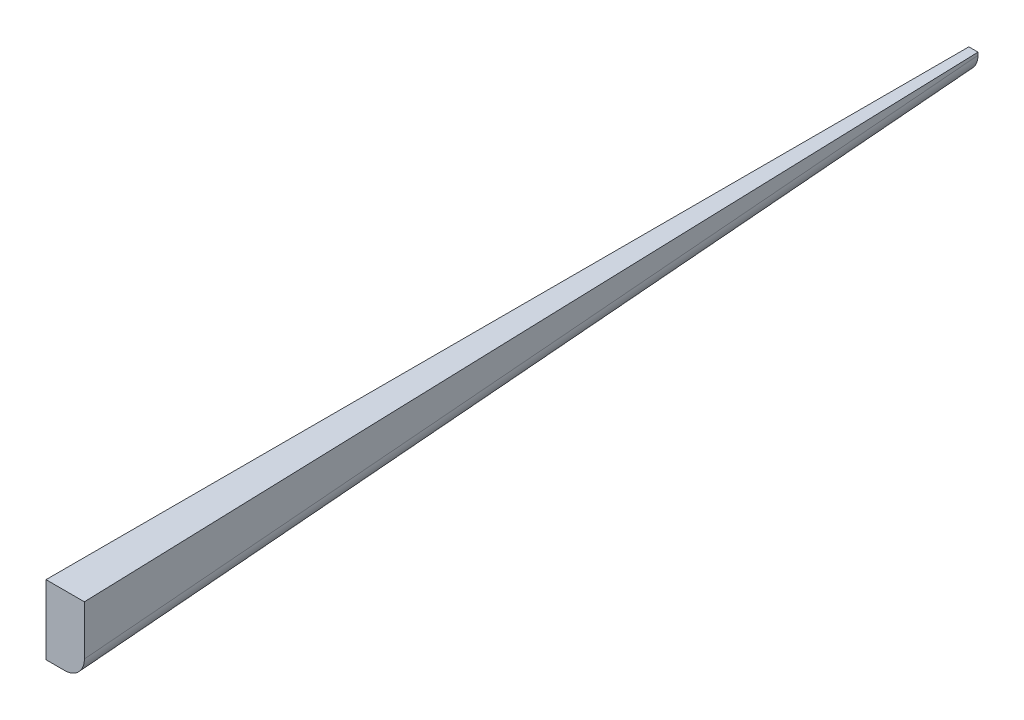
ISO-10303-21;
HEADER;
FILE_DESCRIPTION(('STEP AP214'),'2;1');
FILE_NAME('part.step','',(''),(''),'','','');
FILE_SCHEMA(('AUTOMOTIVE_DESIGN { 1 0 10303 214 1 1 1 1 }'));
ENDSEC;
DATA;
#1=APPLICATION_CONTEXT('core data for automotive mechanical design processes');
#2=APPLICATION_PROTOCOL_DEFINITION('international standard','automotive_design',2000,#1);
#3=PRODUCT_CONTEXT('',#1,'mechanical');
#4=PRODUCT('Part','Part','',(#3));
#5=PRODUCT_RELATED_PRODUCT_CATEGORY('part','',(#4));
#6=PRODUCT_DEFINITION_FORMATION('','',#4);
#7=PRODUCT_DEFINITION_CONTEXT('part definition',#1,'design');
#8=PRODUCT_DEFINITION('design','',#6,#7);
#9=PRODUCT_DEFINITION_SHAPE('','',#8);
#10=(LENGTH_UNIT() NAMED_UNIT(*) SI_UNIT(.MILLI.,.METRE.));
#11=(NAMED_UNIT(*) PLANE_ANGLE_UNIT() SI_UNIT($,.RADIAN.));
#12=(NAMED_UNIT(*) SI_UNIT($,.STERADIAN.) SOLID_ANGLE_UNIT());
#13=UNCERTAINTY_MEASURE_WITH_UNIT(LENGTH_MEASURE(1.E-05),#10,'distance_accuracy_value','');
#14=(GEOMETRIC_REPRESENTATION_CONTEXT(3) GLOBAL_UNCERTAINTY_ASSIGNED_CONTEXT((#13)) GLOBAL_UNIT_ASSIGNED_CONTEXT((#10,
#11,#12)) REPRESENTATION_CONTEXT('',''));
#15=CARTESIAN_POINT('',(0.,0.,0.));
#16=DIRECTION('',(0.,0.,1.));
#17=DIRECTION('',(1.,0.,0.));
#18=AXIS2_PLACEMENT_3D('',#15,#16,#17);
#19=CARTESIAN_POINT('',(0.,0.,-584.2));
#20=DIRECTION('',(0.,0.,1.));
#21=DIRECTION('',(1.,0.,0.));
#22=AXIS2_PLACEMENT_3D('',#19,#20,#21);
#23=PLANE('',#22);
#24=DIRECTION('',(1.,0.,0.));
#25=VECTOR('',#24,1.);
#26=CARTESIAN_POINT('',(0.,5.96900000000002,-584.2));
#27=LINE('',#26,#25);
#28=CARTESIAN_POINT('',(18.161,5.96900000000002,-584.2));
#29=VERTEX_POINT('',#28);
#30=CARTESIAN_POINT('',(42.6703226354349,5.96900000000002,-584.2));
#31=VERTEX_POINT('',#30);
#32=EDGE_CURVE('E111',#29,#31,#27,.T.);
#33=ORIENTED_EDGE('',*,*,#32,.F.);
#34=DIRECTION('',(0.,-1.,0.));
#35=VECTOR('',#34,1.);
#36=CARTESIAN_POINT('',(18.161,0.,-584.2));
#37=LINE('',#36,#35);
#38=CARTESIAN_POINT('',(18.161,-38.3259162166958,-584.2));
#39=VERTEX_POINT('',#38);
#40=EDGE_CURVE('E98',#29,#39,#37,.T.);
#41=ORIENTED_EDGE('',*,*,#40,.T.);
#42=DIRECTION('',(1.,0.,0.));
#43=VECTOR('',#42,1.);
#44=CARTESIAN_POINT('',(0.,-38.3259162166958,-584.2));
#45=LINE('',#44,#43);
#46=CARTESIAN_POINT('',(29.9843258252833,-38.3259162166958,-584.2));
#47=VERTEX_POINT('',#46);
#48=EDGE_CURVE('E109',#39,#47,#45,.T.);
#49=ORIENTED_EDGE('',*,*,#48,.T.);
#50=CARTESIAN_POINT('',(29.9639479786131,-25.6096034762046,-584.2));
#51=DIRECTION('',(0.,0.,1.));
#52=DIRECTION('',(0.52999894000318,-0.847998304005088,0.));
#53=AXIS2_PLACEMENT_3D('',#50,#51,#52);
#54=ELLIPSE('',#53,12.7226792238703,12.7);
#55=CARTESIAN_POINT('',(42.6703226354349,-25.6299972610752,-584.2));
#56=VERTEX_POINT('',#55);
#57=EDGE_CURVE('E132',#56,#47,#54,.F.);
#58=ORIENTED_EDGE('',*,*,#57,.F.);
#59=DIRECTION('',(0.,1.,0.));
#60=VECTOR('',#59,1.);
#61=CARTESIAN_POINT('',(42.6703226354349,0.,-584.2));
#62=LINE('',#61,#60);
#63=EDGE_CURVE('E112',#56,#31,#62,.T.);
#64=ORIENTED_EDGE('',*,*,#63,.T.);
#65=EDGE_LOOP('',(#33,#41,#49,#58,#64));
#66=FACE_BOUND('',#65,.T.);
#67=ADVANCED_FACE('F45',(#66),#23,.T.);
#68=CARTESIAN_POINT('',(0.,5.96900000000002,0.));
#69=DIRECTION('',(0.,1.,0.));
#70=DIRECTION('',(0.,0.,1.));
#71=AXIS2_PLACEMENT_3D('',#68,#69,#70);
#72=PLANE('',#71);
#73=DIRECTION('',(0.,0.,1.));
#74=VECTOR('',#73,1.);
#75=CARTESIAN_POINT('',(18.161,5.96900000000002,0.));
#76=LINE('',#75,#74);
#77=CARTESIAN_POINT('',(18.161,5.96900000000002,-1173.17130026192));
#78=VERTEX_POINT('',#77);
#79=EDGE_CURVE('E125',#78,#29,#76,.T.);
#80=ORIENTED_EDGE('',*,*,#79,.T.);
#81=ORIENTED_EDGE('',*,*,#32,.T.);
#82=DIRECTION('',(-0.0316721902279269,0.,-0.999498310336824));
#83=VECTOR('',#82,1.);
#84=CARTESIAN_POINT('',(61.1211296763861,5.96900000000002,-1.93681172447798));
#85=LINE('',#84,#83);
#86=CARTESIAN_POINT('',(24.0069483527925,5.96900000000002,-1173.17130026192));
#87=VERTEX_POINT('',#86);
#88=EDGE_CURVE('E11',#31,#87,#85,.T.);
#89=ORIENTED_EDGE('',*,*,#88,.T.);
#90=DIRECTION('',(-1.,0.,0.));
#91=VECTOR('',#90,1.);
#92=CARTESIAN_POINT('',(0.,5.96900000000002,-1173.17130026192));
#93=LINE('',#92,#91);
#94=EDGE_CURVE('E54',#87,#78,#93,.T.);
#95=ORIENTED_EDGE('',*,*,#94,.T.);
#96=EDGE_LOOP('',(#80,#81,#89,#95));
#97=FACE_BOUND('',#96,.T.);
#98=ADVANCED_FACE('F143',(#97),#72,.T.);
#99=CARTESIAN_POINT('',(0.,0.,-1173.17130026192));
#100=DIRECTION('',(0.,0.,1.));
#101=DIRECTION('',(1.,0.,0.));
#102=AXIS2_PLACEMENT_3D('',#99,#100,#101);
#103=PLANE('',#102);
#104=ORIENTED_EDGE('',*,*,#94,.F.);
#105=DIRECTION('',(0.,1.,0.));
#106=VECTOR('',#105,1.);
#107=CARTESIAN_POINT('',(24.0069483527925,0.,-1173.17130026192));
#108=LINE('',#107,#106);
#109=CARTESIAN_POINT('',(24.0069483527925,4.23140159115264,-1173.17130026192));
#110=VERTEX_POINT('',#109);
#111=EDGE_CURVE('E124',#110,#87,#108,.T.);
#112=ORIENTED_EDGE('',*,*,#111,.F.);
#113=CARTESIAN_POINT('',(11.3005736959707,4.2517953760232,-1173.17130026192));
#114=DIRECTION('',(0.,0.,1.));
#115=DIRECTION('',(0.52999894000318,-0.847998304005088,0.));
#116=AXIS2_PLACEMENT_3D('',#113,#114,#115);
#117=ELLIPSE('',#116,12.7226792238703,12.7);
#118=CARTESIAN_POINT('',(18.161,-6.46272974411309,-1173.17130026192));
#119=VERTEX_POINT('',#118);
#120=EDGE_CURVE('E104',#110,#119,#117,.F.);
#121=ORIENTED_EDGE('',*,*,#120,.T.);
#122=DIRECTION('',(0.,1.,0.));
#123=VECTOR('',#122,1.);
#124=CARTESIAN_POINT('',(18.161,0.,-1173.17130026192));
#125=LINE('',#124,#123);
#126=EDGE_CURVE('E68',#119,#78,#125,.T.);
#127=ORIENTED_EDGE('',*,*,#126,.T.);
#128=EDGE_LOOP('',(#104,#112,#121,#127));
#129=FACE_BOUND('',#128,.T.);
#130=ADVANCED_FACE('F142',(#129),#103,.F.);
#131=CARTESIAN_POINT('',(18.161,0.,0.));
#132=DIRECTION('',(1.,0.,0.));
#133=DIRECTION('',(0.,0.,-1.));
#134=AXIS2_PLACEMENT_3D('',#131,#132,#133);
#135=PLANE('',#134);
#136=ORIENTED_EDGE('',*,*,#40,.F.);
#137=ORIENTED_EDGE('',*,*,#79,.F.);
#138=ORIENTED_EDGE('',*,*,#126,.F.);
#139=CARTESIAN_POINT('',(18.161,-6.72488671042363,-956.672711129881));
#140=DIRECTION('',(1.,0.,0.));
#141=DIRECTION('',(0.,-0.0506359003212277,0.998717179985735));
#142=AXIS2_PLACEMENT_3D('',#139,#140,#141);
#143=ELLIPSE('',#142,401.497221875208,12.7);
#144=CARTESIAN_POINT('',(18.161,-19.4085948962425,-957.315787063961));
#145=VERTEX_POINT('',#144);
#146=EDGE_CURVE('E99',#119,#145,#143,.F.);
#147=ORIENTED_EDGE('',*,*,#146,.T.);
#148=DIRECTION('',(0.,0.0506359003212277,-0.998717179985735));
#149=VECTOR('',#148,1.);
#150=CARTESIAN_POINT('',(18.161,-67.7711940185204,-3.43606327571275));
#151=LINE('',#150,#149);
#152=EDGE_CURVE('E95',#39,#145,#151,.T.);
#153=ORIENTED_EDGE('',*,*,#152,.F.);
#154=EDGE_LOOP('',(#136,#137,#138,#147,#153));
#155=FACE_BOUND('',#154,.T.);
#156=ADVANCED_FACE('F97',(#155),#135,.F.);
#157=CARTESIAN_POINT('',(0.,-67.7711940185204,-3.43606327571275));
#158=DIRECTION('',(0.,0.998717179985735,0.0506359003212277));
#159=DIRECTION('',(0.,-0.0506359003212277,0.998717179985735));
#160=AXIS2_PLACEMENT_3D('',#157,#158,#159);
#161=PLANE('',#160);
#162=ORIENTED_EDGE('',*,*,#48,.F.);
#163=ORIENTED_EDGE('',*,*,#152,.T.);
#164=DIRECTION('',(0.0316316011868878,-0.0506105618990205,0.998217417615331));
#165=VECTOR('',#164,1.);
#166=CARTESIAN_POINT('',(48.3392098173078,-67.6937306039349,-4.96391293329035));
#167=LINE('',#166,#165);
#168=EDGE_CURVE('E115',#145,#47,#167,.T.);
#169=ORIENTED_EDGE('',*,*,#168,.T.);
#170=EDGE_LOOP('',(#162,#163,#169));
#171=FACE_BOUND('',#170,.T.);
#172=ADVANCED_FACE('F114',(#171),#161,.F.);
#173=CARTESIAN_POINT('',(61.1211296763861,0.,-1.93681172447798));
#174=DIRECTION('',(-0.999498310336824,0.,0.0316721902279269));
#175=DIRECTION('',(0.0316721902279269,0.,0.999498310336824));
#176=AXIS2_PLACEMENT_3D('',#173,#174,#175);
#177=PLANE('',#176);
#178=ORIENTED_EDGE('',*,*,#63,.F.);
#179=DIRECTION('',(0.0316316011868878,-0.0506105618990205,0.99821741761533));
#180=VECTOR('',#179,1.);
#181=CARTESIAN_POINT('',(61.0328383585854,-55.010022418116,-4.72307381510543));
#182=LINE('',#181,#180);
#183=EDGE_CURVE('E122',#56,#110,#182,.F.);
#184=ORIENTED_EDGE('',*,*,#183,.T.);
#185=ORIENTED_EDGE('',*,*,#111,.T.);
#186=ORIENTED_EDGE('',*,*,#88,.F.);
#187=EDGE_LOOP('',(#178,#184,#185,#186));
#188=FACE_BOUND('',#187,.T.);
#189=ADVANCED_FACE('F138',(#188),#177,.F.);
#190=CARTESIAN_POINT('',(48.3392098173078,-55.010022418116,-4.32083699921076));
#191=DIRECTION('',(0.0316316011868878,-0.0506105618990205,0.998217417615331));
#192=DIRECTION('',(0.,-0.998717179985735,-0.0506359003212277));
#193=AXIS2_PLACEMENT_3D('',#190,#191,#192);
#194=CYLINDRICAL_SURFACE('',#193,12.7);
#195=ORIENTED_EDGE('',*,*,#183,.F.);
#196=ORIENTED_EDGE('',*,*,#57,.T.);
#197=ORIENTED_EDGE('',*,*,#168,.F.);
#198=ORIENTED_EDGE('',*,*,#146,.F.);
#199=ORIENTED_EDGE('',*,*,#120,.F.);
#200=EDGE_LOOP('',(#195,#196,#197,#198,#199));
#201=FACE_BOUND('',#200,.T.);
#202=ADVANCED_FACE('F47',(#201),#194,.T.);
#203=CLOSED_SHELL('',(#67,#98,#130,#156,#172,#189,#202));
#204=MANIFOLD_SOLID_BREP('B2',#203);
#205=ADVANCED_BREP_SHAPE_REPRESENTATION('',(#18,#204),#14);
#206=SHAPE_DEFINITION_REPRESENTATION(#9,#205);
ENDSEC;
END-ISO-10303-21;
